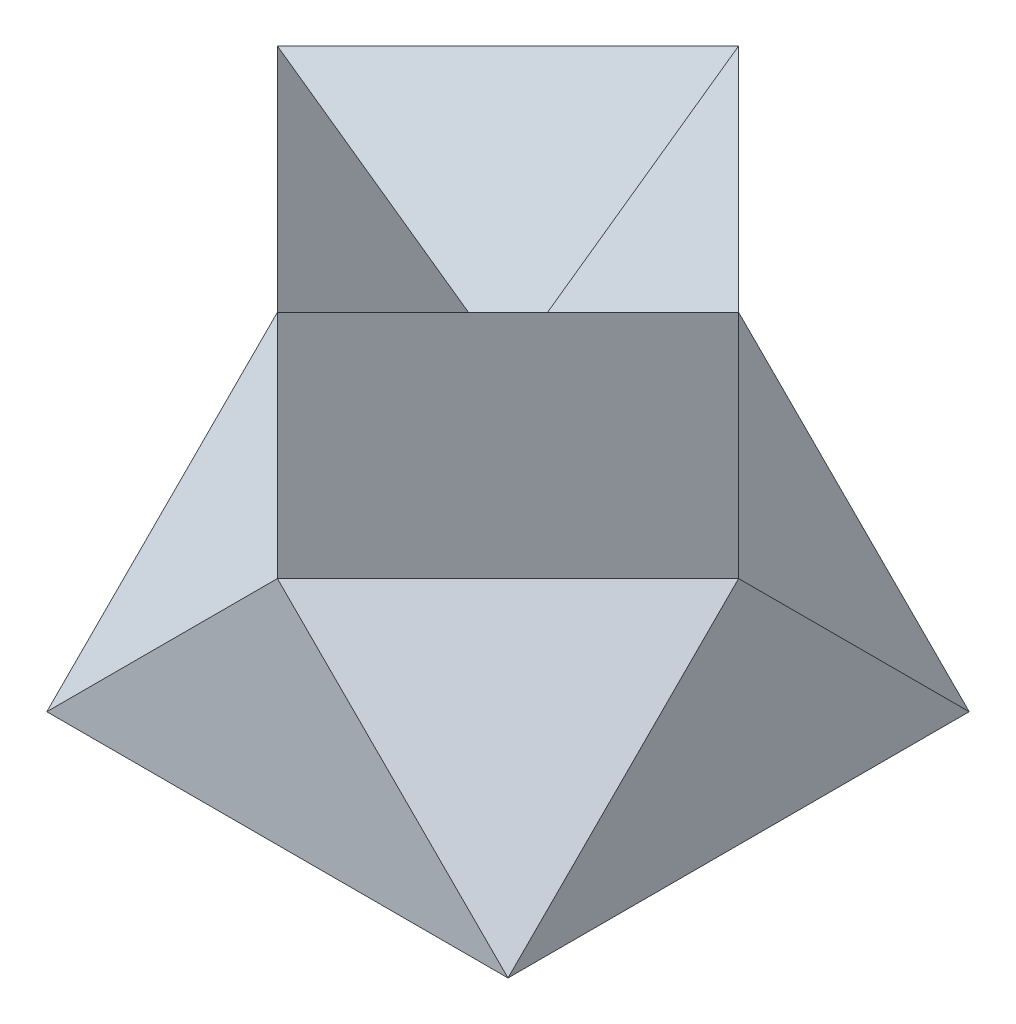
ISO-10303-21;
HEADER;
FILE_DESCRIPTION(('STEP AP214'),'2;1');
FILE_NAME('part.step','',(''),(''),'','','');
FILE_SCHEMA(('AUTOMOTIVE_DESIGN { 1 0 10303 214 1 1 1 1 }'));
ENDSEC;
DATA;
#1=APPLICATION_CONTEXT('core data for automotive mechanical design processes');
#2=APPLICATION_PROTOCOL_DEFINITION('international standard','automotive_design',2000,#1);
#3=PRODUCT_CONTEXT('',#1,'mechanical');
#4=PRODUCT('Part','Part','',(#3));
#5=PRODUCT_RELATED_PRODUCT_CATEGORY('part','',(#4));
#6=PRODUCT_DEFINITION_FORMATION('','',#4);
#7=PRODUCT_DEFINITION_CONTEXT('part definition',#1,'design');
#8=PRODUCT_DEFINITION('design','',#6,#7);
#9=PRODUCT_DEFINITION_SHAPE('','',#8);
#10=(LENGTH_UNIT() NAMED_UNIT(*) SI_UNIT(.MILLI.,.METRE.));
#11=(NAMED_UNIT(*) PLANE_ANGLE_UNIT() SI_UNIT($,.RADIAN.));
#12=(NAMED_UNIT(*) SI_UNIT($,.STERADIAN.) SOLID_ANGLE_UNIT());
#13=UNCERTAINTY_MEASURE_WITH_UNIT(LENGTH_MEASURE(1.E-05),#10,'distance_accuracy_value','');
#14=(GEOMETRIC_REPRESENTATION_CONTEXT(3) GLOBAL_UNCERTAINTY_ASSIGNED_CONTEXT((#13)) GLOBAL_UNIT_ASSIGNED_CONTEXT((#10,
#11,#12)) REPRESENTATION_CONTEXT('',''));
#15=CARTESIAN_POINT('',(0.,0.,0.));
#16=DIRECTION('',(0.,0.,1.));
#17=DIRECTION('',(1.,0.,0.));
#18=AXIS2_PLACEMENT_3D('',#15,#16,#17);
#19=CARTESIAN_POINT('',(-2.,4.,2.));
#20=DIRECTION('',(1.,0.,0.));
#21=DIRECTION('',(0.,0.,-1.));
#22=AXIS2_PLACEMENT_3D('',#19,#20,#21);
#23=PLANE('',#22);
#24=DIRECTION('',(0.,-0.707106781186548,-0.707106781186548));
#25=VECTOR('',#24,1.);
#26=CARTESIAN_POINT('',(-2.,2.,0.));
#27=LINE('',#26,#25);
#28=CARTESIAN_POINT('',(-2.,2.,0.));
#29=VERTEX_POINT('',#28);
#30=CARTESIAN_POINT('',(-2.,0.,-2.));
#31=VERTEX_POINT('',#30);
#32=EDGE_CURVE('E106',#29,#31,#27,.T.);
#33=ORIENTED_EDGE('',*,*,#32,.T.);
#34=DIRECTION('',(0.,0.,1.));
#35=VECTOR('',#34,1.);
#36=CARTESIAN_POINT('',(-2.,0.,2.));
#37=LINE('',#36,#35);
#38=CARTESIAN_POINT('',(-2.,0.,2.));
#39=VERTEX_POINT('',#38);
#40=EDGE_CURVE('E50',#31,#39,#37,.T.);
#41=ORIENTED_EDGE('',*,*,#40,.T.);
#42=DIRECTION('',(0.,-0.707106781186548,0.707106781186548));
#43=VECTOR('',#42,1.);
#44=CARTESIAN_POINT('',(-2.,2.,0.));
#45=LINE('',#44,#43);
#46=EDGE_CURVE('E112',#29,#39,#45,.T.);
#47=ORIENTED_EDGE('',*,*,#46,.F.);
#48=EDGE_LOOP('',(#33,#41,#47));
#49=FACE_BOUND('',#48,.T.);
#50=ADVANCED_FACE('F41',(#49),#23,.F.);
#51=CARTESIAN_POINT('',(-2.,4.,2.));
#52=DIRECTION('',(0.,0.,-1.));
#53=DIRECTION('',(-1.,0.,0.));
#54=AXIS2_PLACEMENT_3D('',#51,#52,#53);
#55=PLANE('',#54);
#56=DIRECTION('',(-0.707106781186548,0.707106781186547,0.));
#57=VECTOR('',#56,1.);
#58=CARTESIAN_POINT('',(2.,0.,2.));
#59=LINE('',#58,#57);
#60=CARTESIAN_POINT('',(2.,0.,2.));
#61=VERTEX_POINT('',#60);
#62=CARTESIAN_POINT('',(0.,2.,2.));
#63=VERTEX_POINT('',#62);
#64=EDGE_CURVE('E230',#61,#63,#59,.T.);
#65=ORIENTED_EDGE('',*,*,#64,.T.);
#66=DIRECTION('',(0.707106781186548,0.707106781186547,0.));
#67=VECTOR('',#66,1.);
#68=CARTESIAN_POINT('',(-2.,0.,2.));
#69=LINE('',#68,#67);
#70=EDGE_CURVE('E233',#39,#63,#69,.T.);
#71=ORIENTED_EDGE('',*,*,#70,.F.);
#72=DIRECTION('',(1.,0.,0.));
#73=VECTOR('',#72,1.);
#74=CARTESIAN_POINT('',(-2.,0.,2.));
#75=LINE('',#74,#73);
#76=EDGE_CURVE('E12',#39,#61,#75,.T.);
#77=ORIENTED_EDGE('',*,*,#76,.T.);
#78=EDGE_LOOP('',(#65,#71,#77));
#79=FACE_BOUND('',#78,.T.);
#80=ADVANCED_FACE('F252',(#79),#55,.F.);
#81=CARTESIAN_POINT('',(2.,4.,2.));
#82=DIRECTION('',(-1.,0.,0.));
#83=DIRECTION('',(0.,0.,1.));
#84=AXIS2_PLACEMENT_3D('',#81,#82,#83);
#85=PLANE('',#84);
#86=DIRECTION('',(0.,0.,-1.));
#87=VECTOR('',#86,1.);
#88=CARTESIAN_POINT('',(2.,0.,2.));
#89=LINE('',#88,#87);
#90=CARTESIAN_POINT('',(2.,0.,-2.));
#91=VERTEX_POINT('',#90);
#92=EDGE_CURVE('E197',#61,#91,#89,.T.);
#93=ORIENTED_EDGE('',*,*,#92,.T.);
#94=DIRECTION('',(0.,-0.707106781186548,-0.707106781186548));
#95=VECTOR('',#94,1.);
#96=CARTESIAN_POINT('',(2.,2.,0.));
#97=LINE('',#96,#95);
#98=CARTESIAN_POINT('',(2.,2.,0.));
#99=VERTEX_POINT('',#98);
#100=EDGE_CURVE('E128',#99,#91,#97,.T.);
#101=ORIENTED_EDGE('',*,*,#100,.F.);
#102=DIRECTION('',(0.,-0.707106781186548,0.707106781186548));
#103=VECTOR('',#102,1.);
#104=CARTESIAN_POINT('',(2.,2.,0.));
#105=LINE('',#104,#103);
#106=EDGE_CURVE('E213',#99,#61,#105,.T.);
#107=ORIENTED_EDGE('',*,*,#106,.T.);
#108=EDGE_LOOP('',(#93,#101,#107));
#109=FACE_BOUND('',#108,.T.);
#110=ADVANCED_FACE('F43',(#109),#85,.F.);
#111=CARTESIAN_POINT('',(-2.,4.,-2.));
#112=DIRECTION('',(0.,0.,1.));
#113=DIRECTION('',(1.,0.,0.));
#114=AXIS2_PLACEMENT_3D('',#111,#112,#113);
#115=PLANE('',#114);
#116=DIRECTION('',(-1.,0.,0.));
#117=VECTOR('',#116,1.);
#118=CARTESIAN_POINT('',(-2.,0.,-2.));
#119=LINE('',#118,#117);
#120=EDGE_CURVE('E121',#91,#31,#119,.T.);
#121=ORIENTED_EDGE('',*,*,#120,.T.);
#122=DIRECTION('',(0.707106781186548,0.707106781186547,0.));
#123=VECTOR('',#122,1.);
#124=CARTESIAN_POINT('',(-2.,0.,-2.));
#125=LINE('',#124,#123);
#126=CARTESIAN_POINT('',(0.,2.,-2.));
#127=VERTEX_POINT('',#126);
#128=EDGE_CURVE('E104',#31,#127,#125,.T.);
#129=ORIENTED_EDGE('',*,*,#128,.T.);
#130=DIRECTION('',(-0.707106781186548,0.707106781186547,0.));
#131=VECTOR('',#130,1.);
#132=CARTESIAN_POINT('',(2.,0.,-2.));
#133=LINE('',#132,#131);
#134=EDGE_CURVE('E119',#91,#127,#133,.T.);
#135=ORIENTED_EDGE('',*,*,#134,.F.);
#136=EDGE_LOOP('',(#121,#129,#135));
#137=FACE_BOUND('',#136,.T.);
#138=ADVANCED_FACE('F118',(#137),#115,.F.);
#139=CARTESIAN_POINT('',(0.,0.,0.));
#140=DIRECTION('',(0.,-1.,0.));
#141=DIRECTION('',(0.,0.,-1.));
#142=AXIS2_PLACEMENT_3D('',#139,#140,#141);
#143=PLANE('',#142);
#144=ORIENTED_EDGE('',*,*,#92,.F.);
#145=ORIENTED_EDGE('',*,*,#76,.F.);
#146=ORIENTED_EDGE('',*,*,#40,.F.);
#147=ORIENTED_EDGE('',*,*,#120,.F.);
#148=EDGE_LOOP('',(#144,#145,#146,#147));
#149=FACE_BOUND('',#148,.T.);
#150=ADVANCED_FACE('F216',(#149),#143,.T.);
#151=CARTESIAN_POINT('',(-2.,4.,0.));
#152=DIRECTION('',(-0.499999999999999,-0.707106781186549,-0.499999999999999));
#153=DIRECTION('',(0.816496580927727,-0.577350269189625,0.));
#154=AXIS2_PLACEMENT_3D('',#151,#152,#153);
#155=PLANE('',#154);
#156=DIRECTION('',(-0.707106781186547,0.,0.707106781186548));
#157=VECTOR('',#156,1.);
#158=CARTESIAN_POINT('',(-2.,4.,0.));
#159=LINE('',#158,#157);
#160=CARTESIAN_POINT('',(0.,4.,-2.));
#161=VERTEX_POINT('',#160);
#162=CARTESIAN_POINT('',(-2.,4.,0.));
#163=VERTEX_POINT('',#162);
#164=EDGE_CURVE('E134',#161,#163,#159,.T.);
#165=ORIENTED_EDGE('',*,*,#164,.T.);
#166=DIRECTION('',(-0.816496580927727,0.577350269189625,0.));
#167=VECTOR('',#166,1.);
#168=CARTESIAN_POINT('',(-2.,4.,0.));
#169=LINE('',#168,#167);
#170=CARTESIAN_POINT('',(0.,2.58578643762691,0.));
#171=VERTEX_POINT('',#170);
#172=EDGE_CURVE('E169',#171,#163,#169,.T.);
#173=ORIENTED_EDGE('',*,*,#172,.F.);
#174=DIRECTION('',(0.,0.577350269189624,-0.816496580927727));
#175=VECTOR('',#174,1.);
#176=CARTESIAN_POINT('',(0.,4.,-2.));
#177=LINE('',#176,#175);
#178=EDGE_CURVE('E189',#171,#161,#177,.T.);
#179=ORIENTED_EDGE('',*,*,#178,.T.);
#180=EDGE_LOOP('',(#165,#173,#179));
#181=FACE_BOUND('',#180,.T.);
#182=ADVANCED_FACE('F262',(#181),#155,.F.);
#183=CARTESIAN_POINT('',(0.,4.,-2.));
#184=DIRECTION('',(0.499999999999999,-0.707106781186549,-0.499999999999999));
#185=DIRECTION('',(0.,0.577350269189625,-0.816496580927727));
#186=AXIS2_PLACEMENT_3D('',#183,#184,#185);
#187=PLANE('',#186);
#188=DIRECTION('',(-0.707106781186548,0.,-0.707106781186547));
#189=VECTOR('',#188,1.);
#190=CARTESIAN_POINT('',(0.,4.,-2.));
#191=LINE('',#190,#189);
#192=CARTESIAN_POINT('',(2.,4.,0.));
#193=VERTEX_POINT('',#192);
#194=EDGE_CURVE('E178',#193,#161,#191,.T.);
#195=ORIENTED_EDGE('',*,*,#194,.T.);
#196=ORIENTED_EDGE('',*,*,#178,.F.);
#197=DIRECTION('',(0.816496580927727,0.577350269189624,0.));
#198=VECTOR('',#197,1.);
#199=CARTESIAN_POINT('',(0.666666666666662,3.05719095841794,0.));
#200=LINE('',#199,#198);
#201=EDGE_CURVE('E58',#171,#193,#200,.T.);
#202=ORIENTED_EDGE('',*,*,#201,.T.);
#203=EDGE_LOOP('',(#195,#196,#202));
#204=FACE_BOUND('',#203,.T.);
#205=ADVANCED_FACE('F267',(#204),#187,.F.);
#206=CARTESIAN_POINT('',(0.,4.,2.));
#207=DIRECTION('',(0.499999999999999,-0.707106781186549,0.499999999999999));
#208=DIRECTION('',(0.816496580927727,0.577350269189625,0.));
#209=AXIS2_PLACEMENT_3D('',#206,#207,#208);
#210=PLANE('',#209);
#211=DIRECTION('',(0.707106781186547,0.,-0.707106781186548));
#212=VECTOR('',#211,1.);
#213=CARTESIAN_POINT('',(0.,4.,2.));
#214=LINE('',#213,#212);
#215=CARTESIAN_POINT('',(0.,4.,2.));
#216=VERTEX_POINT('',#215);
#217=EDGE_CURVE('E65',#216,#193,#214,.T.);
#218=ORIENTED_EDGE('',*,*,#217,.T.);
#219=ORIENTED_EDGE('',*,*,#201,.F.);
#220=DIRECTION('',(0.,0.577350269189624,0.816496580927727));
#221=VECTOR('',#220,1.);
#222=CARTESIAN_POINT('',(0.,3.05719095841794,0.666666666666663));
#223=LINE('',#222,#221);
#224=EDGE_CURVE('E167',#171,#216,#223,.T.);
#225=ORIENTED_EDGE('',*,*,#224,.T.);
#226=EDGE_LOOP('',(#218,#219,#225));
#227=FACE_BOUND('',#226,.T.);
#228=ADVANCED_FACE('F265',(#227),#210,.F.);
#229=CARTESIAN_POINT('',(-2.,4.,0.));
#230=DIRECTION('',(-0.499999999999999,-0.707106781186549,0.499999999999999));
#231=DIRECTION('',(0.,-0.577350269189625,-0.816496580927727));
#232=AXIS2_PLACEMENT_3D('',#229,#230,#231);
#233=PLANE('',#232);
#234=DIRECTION('',(0.707106781186548,0.,0.707106781186547));
#235=VECTOR('',#234,1.);
#236=CARTESIAN_POINT('',(-2.,4.,0.));
#237=LINE('',#236,#235);
#238=EDGE_CURVE('E172',#163,#216,#237,.T.);
#239=ORIENTED_EDGE('',*,*,#238,.T.);
#240=ORIENTED_EDGE('',*,*,#224,.F.);
#241=ORIENTED_EDGE('',*,*,#172,.T.);
#242=EDGE_LOOP('',(#239,#240,#241));
#243=FACE_BOUND('',#242,.T.);
#244=ADVANCED_FACE('F264',(#243),#233,.F.);
#245=CARTESIAN_POINT('',(-0.999999999999999,0.,0.999999999999999));
#246=DIRECTION('',(0.707106781186548,0.,-0.707106781186547));
#247=DIRECTION('',(-0.707106781186547,0.,-0.707106781186548));
#248=AXIS2_PLACEMENT_3D('',#245,#246,#247);
#249=PLANE('',#248);
#250=DIRECTION('',(0.,1.,0.));
#251=VECTOR('',#250,1.);
#252=CARTESIAN_POINT('',(-2.,2.,0.));
#253=LINE('',#252,#251);
#254=EDGE_CURVE('E150',#29,#163,#253,.T.);
#255=ORIENTED_EDGE('',*,*,#254,.F.);
#256=DIRECTION('',(-0.707106781186548,0.,-0.707106781186547));
#257=VECTOR('',#256,1.);
#258=CARTESIAN_POINT('',(0.,2.,2.));
#259=LINE('',#258,#257);
#260=EDGE_CURVE('E157',#63,#29,#259,.T.);
#261=ORIENTED_EDGE('',*,*,#260,.F.);
#262=DIRECTION('',(0.,-1.,0.));
#263=VECTOR('',#262,1.);
#264=CARTESIAN_POINT('',(0.,4.,2.));
#265=LINE('',#264,#263);
#266=EDGE_CURVE('E160',#216,#63,#265,.T.);
#267=ORIENTED_EDGE('',*,*,#266,.F.);
#268=ORIENTED_EDGE('',*,*,#238,.F.);
#269=EDGE_LOOP('',(#255,#261,#267,#268));
#270=FACE_BOUND('',#269,.T.);
#271=ADVANCED_FACE('F258',(#270),#249,.F.);
#272=CARTESIAN_POINT('',(1.,0.,1.));
#273=DIRECTION('',(0.707106781186548,0.,0.707106781186547));
#274=DIRECTION('',(0.707106781186547,0.,-0.707106781186548));
#275=AXIS2_PLACEMENT_3D('',#272,#273,#274);
#276=PLANE('',#275);
#277=DIRECTION('',(0.,1.,0.));
#278=VECTOR('',#277,1.);
#279=CARTESIAN_POINT('',(2.,2.,0.));
#280=LINE('',#279,#278);
#281=EDGE_CURVE('E141',#99,#193,#280,.T.);
#282=ORIENTED_EDGE('',*,*,#281,.T.);
#283=ORIENTED_EDGE('',*,*,#217,.F.);
#284=ORIENTED_EDGE('',*,*,#266,.T.);
#285=DIRECTION('',(0.707106781186548,0.,-0.707106781186547));
#286=VECTOR('',#285,1.);
#287=CARTESIAN_POINT('',(0.,2.,2.));
#288=LINE('',#287,#286);
#289=EDGE_CURVE('E137',#63,#99,#288,.T.);
#290=ORIENTED_EDGE('',*,*,#289,.T.);
#291=EDGE_LOOP('',(#282,#283,#284,#290));
#292=FACE_BOUND('',#291,.T.);
#293=ADVANCED_FACE('F255',(#292),#276,.T.);
#294=CARTESIAN_POINT('',(1.,0.,-0.999999999999999));
#295=DIRECTION('',(0.707106781186548,0.,-0.707106781186547));
#296=DIRECTION('',(-0.707106781186547,0.,-0.707106781186548));
#297=AXIS2_PLACEMENT_3D('',#294,#295,#296);
#298=PLANE('',#297);
#299=ORIENTED_EDGE('',*,*,#194,.F.);
#300=ORIENTED_EDGE('',*,*,#281,.F.);
#301=DIRECTION('',(0.707106781186548,0.,0.707106781186547));
#302=VECTOR('',#301,1.);
#303=CARTESIAN_POINT('',(0.,2.,-2.));
#304=LINE('',#303,#302);
#305=EDGE_CURVE('E111',#127,#99,#304,.T.);
#306=ORIENTED_EDGE('',*,*,#305,.F.);
#307=DIRECTION('',(0.,-1.,0.));
#308=VECTOR('',#307,1.);
#309=CARTESIAN_POINT('',(0.,4.,-2.));
#310=LINE('',#309,#308);
#311=EDGE_CURVE('E131',#161,#127,#310,.T.);
#312=ORIENTED_EDGE('',*,*,#311,.F.);
#313=EDGE_LOOP('',(#299,#300,#306,#312));
#314=FACE_BOUND('',#313,.T.);
#315=ADVANCED_FACE('F140',(#314),#298,.T.);
#316=CARTESIAN_POINT('',(-1.,0.,-1.));
#317=DIRECTION('',(0.707106781186548,0.,0.707106781186547));
#318=DIRECTION('',(0.707106781186547,0.,-0.707106781186548));
#319=AXIS2_PLACEMENT_3D('',#316,#317,#318);
#320=PLANE('',#319);
#321=ORIENTED_EDGE('',*,*,#164,.F.);
#322=ORIENTED_EDGE('',*,*,#311,.T.);
#323=DIRECTION('',(-0.707106781186548,0.,0.707106781186547));
#324=VECTOR('',#323,1.);
#325=CARTESIAN_POINT('',(0.,2.,-2.));
#326=LINE('',#325,#324);
#327=EDGE_CURVE('E101',#127,#29,#326,.T.);
#328=ORIENTED_EDGE('',*,*,#327,.T.);
#329=ORIENTED_EDGE('',*,*,#254,.T.);
#330=EDGE_LOOP('',(#321,#322,#328,#329));
#331=FACE_BOUND('',#330,.T.);
#332=ADVANCED_FACE('F132',(#331),#320,.F.);
#333=CARTESIAN_POINT('',(-1.33333333333333,1.33333333333333,1.33333333333333));
#334=DIRECTION('',(-0.577350269189626,0.577350269189625,0.577350269189626));
#335=DIRECTION('',(0.707106781186548,0.,0.707106781186547));
#336=AXIS2_PLACEMENT_3D('',#333,#334,#335);
#337=PLANE('',#336);
#338=ORIENTED_EDGE('',*,*,#70,.T.);
#339=ORIENTED_EDGE('',*,*,#260,.T.);
#340=ORIENTED_EDGE('',*,*,#46,.T.);
#341=EDGE_LOOP('',(#338,#339,#340));
#342=FACE_BOUND('',#341,.T.);
#343=ADVANCED_FACE('F249',(#342),#337,.T.);
#344=CARTESIAN_POINT('',(1.33333333333333,1.33333333333333,1.33333333333333));
#345=DIRECTION('',(0.577350269189625,0.577350269189626,0.577350269189627));
#346=DIRECTION('',(0.,-0.707106781186548,0.707106781186547));
#347=AXIS2_PLACEMENT_3D('',#344,#345,#346);
#348=PLANE('',#347);
#349=ORIENTED_EDGE('',*,*,#289,.F.);
#350=ORIENTED_EDGE('',*,*,#64,.F.);
#351=ORIENTED_EDGE('',*,*,#106,.F.);
#352=EDGE_LOOP('',(#349,#350,#351));
#353=FACE_BOUND('',#352,.T.);
#354=ADVANCED_FACE('F254',(#353),#348,.T.);
#355=CARTESIAN_POINT('',(1.33333333333333,1.33333333333333,-1.33333333333333));
#356=DIRECTION('',(-0.577350269189625,-0.577350269189626,0.577350269189627));
#357=DIRECTION('',(0.,-0.707106781186548,-0.707106781186547));
#358=AXIS2_PLACEMENT_3D('',#355,#356,#357);
#359=PLANE('',#358);
#360=ORIENTED_EDGE('',*,*,#305,.T.);
#361=ORIENTED_EDGE('',*,*,#100,.T.);
#362=ORIENTED_EDGE('',*,*,#134,.T.);
#363=EDGE_LOOP('',(#360,#361,#362));
#364=FACE_BOUND('',#363,.T.);
#365=ADVANCED_FACE('F125',(#364),#359,.F.);
#366=CARTESIAN_POINT('',(-1.33333333333333,1.33333333333333,-1.33333333333333));
#367=DIRECTION('',(0.577350269189626,-0.577350269189625,0.577350269189626));
#368=DIRECTION('',(0.707106781186548,0.,-0.707106781186547));
#369=AXIS2_PLACEMENT_3D('',#366,#367,#368);
#370=PLANE('',#369);
#371=ORIENTED_EDGE('',*,*,#128,.F.);
#372=ORIENTED_EDGE('',*,*,#32,.F.);
#373=ORIENTED_EDGE('',*,*,#327,.F.);
#374=EDGE_LOOP('',(#371,#372,#373));
#375=FACE_BOUND('',#374,.T.);
#376=ADVANCED_FACE('F103',(#375),#370,.F.);
#377=CLOSED_SHELL('',(#50,#80,#110,#138,#150,#182,#205,#228,#244,#271,#293,#315,#332,#343,#354,
#365,#376));
#378=MANIFOLD_SOLID_BREP('B2',#377);
#379=ADVANCED_BREP_SHAPE_REPRESENTATION('',(#18,#378),#14);
#380=SHAPE_DEFINITION_REPRESENTATION(#9,#379);
ENDSEC;
END-ISO-10303-21;
